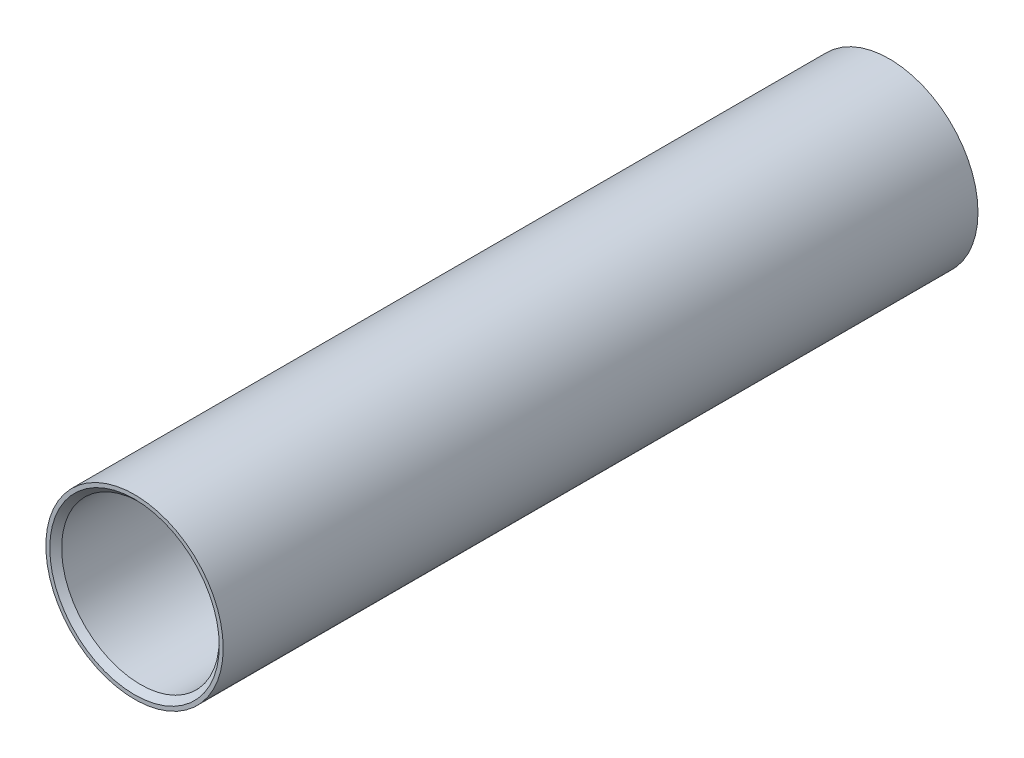
ISO-10303-21;
HEADER;
FILE_DESCRIPTION(('STEP AP214'),'2;1');
FILE_NAME('part.step','',(''),(''),'','','');
FILE_SCHEMA(('AUTOMOTIVE_DESIGN { 1 0 10303 214 1 1 1 1 }'));
ENDSEC;
DATA;
#1=APPLICATION_CONTEXT('core data for automotive mechanical design processes');
#2=APPLICATION_PROTOCOL_DEFINITION('international standard','automotive_design',2000,#1);
#3=PRODUCT_CONTEXT('',#1,'mechanical');
#4=PRODUCT('Part','Part','',(#3));
#5=PRODUCT_RELATED_PRODUCT_CATEGORY('part','',(#4));
#6=PRODUCT_DEFINITION_FORMATION('','',#4);
#7=PRODUCT_DEFINITION_CONTEXT('part definition',#1,'design');
#8=PRODUCT_DEFINITION('design','',#6,#7);
#9=PRODUCT_DEFINITION_SHAPE('','',#8);
#10=(LENGTH_UNIT() NAMED_UNIT(*) SI_UNIT(.MILLI.,.METRE.));
#11=(NAMED_UNIT(*) PLANE_ANGLE_UNIT() SI_UNIT($,.RADIAN.));
#12=(NAMED_UNIT(*) SI_UNIT($,.STERADIAN.) SOLID_ANGLE_UNIT());
#13=UNCERTAINTY_MEASURE_WITH_UNIT(LENGTH_MEASURE(1.E-05),#10,'distance_accuracy_value','');
#14=(GEOMETRIC_REPRESENTATION_CONTEXT(3) GLOBAL_UNCERTAINTY_ASSIGNED_CONTEXT((#13)) GLOBAL_UNIT_ASSIGNED_CONTEXT((#10,
#11,#12)) REPRESENTATION_CONTEXT('',''));
#15=CARTESIAN_POINT('',(0.,0.,0.));
#16=DIRECTION('',(0.,0.,1.));
#17=DIRECTION('',(1.,0.,0.));
#18=AXIS2_PLACEMENT_3D('',#15,#16,#17);
#19=CARTESIAN_POINT('',(0.,4.5,19.15));
#20=DIRECTION('',(0.,0.,-1.));
#21=DIRECTION('',(-1.,0.,0.));
#22=AXIS2_PLACEMENT_3D('',#19,#20,#21);
#23=PLANE('',#22);
#24=CARTESIAN_POINT('',(0.,0.,19.15));
#25=DIRECTION('',(0.,0.,1.));
#26=DIRECTION('',(1.,0.,0.));
#27=AXIS2_PLACEMENT_3D('',#24,#25,#26);
#28=CIRCLE('',#27,4.29999999999999);
#29=CARTESIAN_POINT('',(4.29999999999999,0.,19.15));
#30=VERTEX_POINT('',#29);
#31=EDGE_CURVE('E10',#30,#30,#28,.T.);
#32=ORIENTED_EDGE('',*,*,#31,.F.);
#33=EDGE_LOOP('',(#32));
#34=FACE_BOUND('',#33,.T.);
#35=CARTESIAN_POINT('',(0.,0.,19.15));
#36=DIRECTION('',(0.,0.,1.));
#37=DIRECTION('',(1.,0.,0.));
#38=AXIS2_PLACEMENT_3D('',#35,#36,#37);
#39=CIRCLE('',#38,4.5);
#40=CARTESIAN_POINT('',(4.5,0.,19.15));
#41=VERTEX_POINT('',#40);
#42=EDGE_CURVE('E53',#41,#41,#39,.T.);
#43=ORIENTED_EDGE('',*,*,#42,.T.);
#44=EDGE_LOOP('',(#43));
#45=FACE_BOUND('',#44,.T.);
#46=ADVANCED_FACE('F31',(#34,#45),#23,.F.);
#47=CARTESIAN_POINT('',(0.,0.,19.15));
#48=DIRECTION('',(0.,0.,1.));
#49=DIRECTION('',(1.,0.,0.));
#50=AXIS2_PLACEMENT_3D('',#47,#48,#49);
#51=CONICAL_SURFACE('',#50,4.29999999999999,0.785398163397441);
#52=CARTESIAN_POINT('',(0.,0.,18.85));
#53=DIRECTION('',(0.,0.,1.));
#54=DIRECTION('',(1.,0.,0.));
#55=AXIS2_PLACEMENT_3D('',#52,#53,#54);
#56=CIRCLE('',#55,4.);
#57=CARTESIAN_POINT('',(4.,0.,18.85));
#58=VERTEX_POINT('',#57);
#59=EDGE_CURVE('E37',#58,#58,#56,.T.);
#60=ORIENTED_EDGE('',*,*,#59,.F.);
#61=EDGE_LOOP('',(#60));
#62=FACE_BOUND('',#61,.T.);
#63=ORIENTED_EDGE('',*,*,#31,.T.);
#64=EDGE_LOOP('',(#63));
#65=FACE_BOUND('',#64,.T.);
#66=ADVANCED_FACE('F78',(#62,#65),#51,.F.);
#67=CARTESIAN_POINT('',(0.,0.,0.));
#68=DIRECTION('',(0.,0.,1.));
#69=DIRECTION('',(1.,0.,0.));
#70=AXIS2_PLACEMENT_3D('',#67,#68,#69);
#71=CYLINDRICAL_SURFACE('',#70,4.);
#72=CARTESIAN_POINT('',(0.,0.,-18.85));
#73=DIRECTION('',(0.,0.,1.));
#74=DIRECTION('',(1.,0.,0.));
#75=AXIS2_PLACEMENT_3D('',#72,#73,#74);
#76=CIRCLE('',#75,4.);
#77=CARTESIAN_POINT('',(4.,0.,-18.85));
#78=VERTEX_POINT('',#77);
#79=EDGE_CURVE('E41',#78,#78,#76,.T.);
#80=ORIENTED_EDGE('',*,*,#79,.F.);
#81=EDGE_LOOP('',(#80));
#82=FACE_BOUND('',#81,.T.);
#83=ORIENTED_EDGE('',*,*,#59,.T.);
#84=EDGE_LOOP('',(#83));
#85=FACE_BOUND('',#84,.T.);
#86=ADVANCED_FACE('F73',(#82,#85),#71,.F.);
#87=CARTESIAN_POINT('',(0.,0.,-18.85));
#88=DIRECTION('',(0.,0.,-1.));
#89=DIRECTION('',(-1.,0.,0.));
#90=AXIS2_PLACEMENT_3D('',#87,#88,#89);
#91=CONICAL_SURFACE('',#90,4.,0.785398163397453);
#92=CARTESIAN_POINT('',(0.,0.,-19.15));
#93=DIRECTION('',(0.,0.,1.));
#94=DIRECTION('',(1.,0.,0.));
#95=AXIS2_PLACEMENT_3D('',#92,#93,#94);
#96=CIRCLE('',#95,4.3);
#97=CARTESIAN_POINT('',(4.3,0.,-19.15));
#98=VERTEX_POINT('',#97);
#99=EDGE_CURVE('E45',#98,#98,#96,.T.);
#100=ORIENTED_EDGE('',*,*,#99,.F.);
#101=EDGE_LOOP('',(#100));
#102=FACE_BOUND('',#101,.T.);
#103=ORIENTED_EDGE('',*,*,#79,.T.);
#104=EDGE_LOOP('',(#103));
#105=FACE_BOUND('',#104,.T.);
#106=ADVANCED_FACE('F67',(#102,#105),#91,.F.);
#107=CARTESIAN_POINT('',(0.,4.5,-19.15));
#108=DIRECTION('',(0.,0.,1.));
#109=DIRECTION('',(1.,0.,0.));
#110=AXIS2_PLACEMENT_3D('',#107,#108,#109);
#111=PLANE('',#110);
#112=CARTESIAN_POINT('',(0.,0.,-19.15));
#113=DIRECTION('',(0.,0.,1.));
#114=DIRECTION('',(1.,0.,0.));
#115=AXIS2_PLACEMENT_3D('',#112,#113,#114);
#116=CIRCLE('',#115,4.5);
#117=CARTESIAN_POINT('',(4.5,0.,-19.15));
#118=VERTEX_POINT('',#117);
#119=EDGE_CURVE('E50',#118,#118,#116,.T.);
#120=ORIENTED_EDGE('',*,*,#119,.F.);
#121=EDGE_LOOP('',(#120));
#122=FACE_BOUND('',#121,.T.);
#123=ORIENTED_EDGE('',*,*,#99,.T.);
#124=EDGE_LOOP('',(#123));
#125=FACE_BOUND('',#124,.T.);
#126=ADVANCED_FACE('F61',(#122,#125),#111,.F.);
#127=CARTESIAN_POINT('',(0.,0.,0.));
#128=DIRECTION('',(0.,0.,1.));
#129=DIRECTION('',(1.,0.,0.));
#130=AXIS2_PLACEMENT_3D('',#127,#128,#129);
#131=CYLINDRICAL_SURFACE('',#130,4.5);
#132=ORIENTED_EDGE('',*,*,#42,.F.);
#133=EDGE_LOOP('',(#132));
#134=FACE_BOUND('',#133,.T.);
#135=ORIENTED_EDGE('',*,*,#119,.T.);
#136=EDGE_LOOP('',(#135));
#137=FACE_BOUND('',#136,.T.);
#138=ADVANCED_FACE('F58',(#134,#137),#131,.T.);
#139=CLOSED_SHELL('',(#46,#66,#86,#106,#126,#138));
#140=MANIFOLD_SOLID_BREP('B2',#139);
#141=ADVANCED_BREP_SHAPE_REPRESENTATION('',(#18,#140),#14);
#142=SHAPE_DEFINITION_REPRESENTATION(#9,#141);
ENDSEC;
END-ISO-10303-21;
